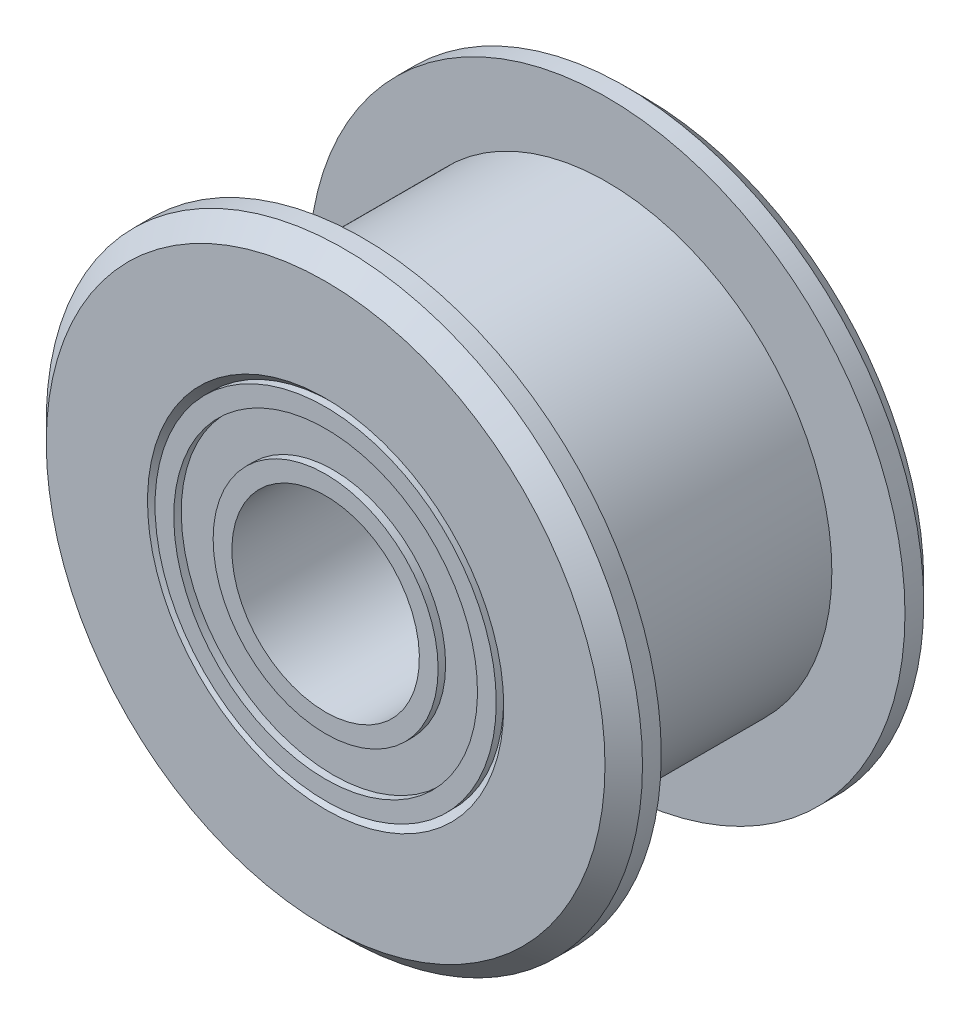
ISO-10303-21;
HEADER;
FILE_DESCRIPTION(('STEP AP214'),'2;1');
FILE_NAME('part.step','',(''),(''),'','','');
FILE_SCHEMA(('AUTOMOTIVE_DESIGN { 1 0 10303 214 1 1 1 1 }'));
ENDSEC;
DATA;
#1=APPLICATION_CONTEXT('core data for automotive mechanical design processes');
#2=APPLICATION_PROTOCOL_DEFINITION('international standard','automotive_design',2000,#1);
#3=PRODUCT_CONTEXT('',#1,'mechanical');
#4=PRODUCT('Part','Part','',(#3));
#5=PRODUCT_RELATED_PRODUCT_CATEGORY('part','',(#4));
#6=PRODUCT_DEFINITION_FORMATION('','',#4);
#7=PRODUCT_DEFINITION_CONTEXT('part definition',#1,'design');
#8=PRODUCT_DEFINITION('design','',#6,#7);
#9=PRODUCT_DEFINITION_SHAPE('','',#8);
#10=(LENGTH_UNIT() NAMED_UNIT(*) SI_UNIT(.MILLI.,.METRE.));
#11=(NAMED_UNIT(*) PLANE_ANGLE_UNIT() SI_UNIT($,.RADIAN.));
#12=(NAMED_UNIT(*) SI_UNIT($,.STERADIAN.) SOLID_ANGLE_UNIT());
#13=UNCERTAINTY_MEASURE_WITH_UNIT(LENGTH_MEASURE(1.E-05),#10,'distance_accuracy_value','');
#14=(GEOMETRIC_REPRESENTATION_CONTEXT(3) GLOBAL_UNCERTAINTY_ASSIGNED_CONTEXT((#13)) GLOBAL_UNIT_ASSIGNED_CONTEXT((#10,
#11,#12)) REPRESENTATION_CONTEXT('',''));
#15=CARTESIAN_POINT('',(0.,0.,0.));
#16=DIRECTION('',(0.,0.,1.));
#17=DIRECTION('',(1.,0.,0.));
#18=AXIS2_PLACEMENT_3D('',#15,#16,#17);
#19=CARTESIAN_POINT('',(0.,0.,-0.75));
#20=DIRECTION('',(0.,0.,1.));
#21=DIRECTION('',(1.,0.,0.));
#22=AXIS2_PLACEMENT_3D('',#19,#20,#21);
#23=CONICAL_SURFACE('',#22,7.7,0.785398163397449);
#24=CARTESIAN_POINT('',(0.,0.,-1.));
#25=DIRECTION('',(0.,0.,1.));
#26=DIRECTION('',(1.,0.,0.));
#27=AXIS2_PLACEMENT_3D('',#24,#25,#26);
#28=CIRCLE('',#27,7.45);
#29=CARTESIAN_POINT('',(7.45,0.,-1.));
#30=VERTEX_POINT('',#29);
#31=EDGE_CURVE('E9',#30,#30,#28,.T.);
#32=ORIENTED_EDGE('',*,*,#31,.T.);
#33=EDGE_LOOP('',(#32));
#34=FACE_BOUND('',#33,.T.);
#35=CARTESIAN_POINT('',(0.,0.,-0.5));
#36=DIRECTION('',(0.,0.,-1.));
#37=DIRECTION('',(0.,-1.,0.));
#38=AXIS2_PLACEMENT_3D('',#35,#36,#37);
#39=CIRCLE('',#38,7.95);
#40=CARTESIAN_POINT('',(0.,-7.95,-0.5));
#41=VERTEX_POINT('',#40);
#42=EDGE_CURVE('E22',#41,#41,#39,.T.);
#43=ORIENTED_EDGE('',*,*,#42,.T.);
#44=EDGE_LOOP('',(#43));
#45=FACE_BOUND('',#44,.T.);
#46=ADVANCED_FACE('F14',(#34,#45),#23,.T.);
#47=CARTESIAN_POINT('',(0.,0.,0.));
#48=DIRECTION('',(0.,0.,1.));
#49=DIRECTION('',(1.,0.,0.));
#50=AXIS2_PLACEMENT_3D('',#47,#48,#49);
#51=CYLINDRICAL_SURFACE('',#50,7.95);
#52=CARTESIAN_POINT('',(0.,0.,0.));
#53=DIRECTION('',(0.,0.,1.));
#54=DIRECTION('',(1.,0.,0.));
#55=AXIS2_PLACEMENT_3D('',#52,#53,#54);
#56=CIRCLE('',#55,7.95);
#57=CARTESIAN_POINT('',(7.95,0.,0.));
#58=VERTEX_POINT('',#57);
#59=EDGE_CURVE('E30',#58,#58,#56,.T.);
#60=ORIENTED_EDGE('',*,*,#59,.F.);
#61=EDGE_LOOP('',(#60));
#62=FACE_BOUND('',#61,.T.);
#63=ORIENTED_EDGE('',*,*,#42,.F.);
#64=EDGE_LOOP('',(#63));
#65=FACE_BOUND('',#64,.T.);
#66=ADVANCED_FACE('F114',(#62,#65),#51,.T.);
#67=CARTESIAN_POINT('',(0.,0.,-1.));
#68=DIRECTION('',(0.,0.,-1.));
#69=DIRECTION('',(-1.,0.,0.));
#70=AXIS2_PLACEMENT_3D('',#67,#68,#69);
#71=PLANE('',#70);
#72=CARTESIAN_POINT('',(0.,0.,-1.));
#73=DIRECTION('',(0.,0.,-1.));
#74=DIRECTION('',(0.,-1.,0.));
#75=AXIS2_PLACEMENT_3D('',#72,#73,#74);
#76=CIRCLE('',#75,4.75);
#77=CARTESIAN_POINT('',(0.,-4.75,-1.));
#78=VERTEX_POINT('',#77);
#79=EDGE_CURVE('E35',#78,#78,#76,.T.);
#80=ORIENTED_EDGE('',*,*,#79,.F.);
#81=EDGE_LOOP('',(#80));
#82=FACE_BOUND('',#81,.T.);
#83=ORIENTED_EDGE('',*,*,#31,.F.);
#84=EDGE_LOOP('',(#83));
#85=FACE_BOUND('',#84,.T.);
#86=ADVANCED_FACE('F119',(#82,#85),#71,.T.);
#87=CARTESIAN_POINT('',(0.,0.,7.25));
#88=DIRECTION('',(0.,0.,-1.));
#89=DIRECTION('',(1.,0.,0.));
#90=AXIS2_PLACEMENT_3D('',#87,#88,#89);
#91=CONICAL_SURFACE('',#90,7.7,0.785398163397448);
#92=CARTESIAN_POINT('',(0.,0.,7.));
#93=DIRECTION('',(0.,0.,1.));
#94=DIRECTION('',(1.,0.,0.));
#95=AXIS2_PLACEMENT_3D('',#92,#93,#94);
#96=CIRCLE('',#95,7.95);
#97=CARTESIAN_POINT('',(7.95,0.,7.));
#98=VERTEX_POINT('',#97);
#99=EDGE_CURVE('E27',#98,#98,#96,.T.);
#100=ORIENTED_EDGE('',*,*,#99,.T.);
#101=EDGE_LOOP('',(#100));
#102=FACE_BOUND('',#101,.T.);
#103=CARTESIAN_POINT('',(0.,0.,7.5));
#104=DIRECTION('',(0.,0.,-1.));
#105=DIRECTION('',(0.,-1.,0.));
#106=AXIS2_PLACEMENT_3D('',#103,#104,#105);
#107=CIRCLE('',#106,7.45);
#108=CARTESIAN_POINT('',(0.,-7.45,7.5));
#109=VERTEX_POINT('',#108);
#110=EDGE_CURVE('E42',#109,#109,#107,.T.);
#111=ORIENTED_EDGE('',*,*,#110,.T.);
#112=EDGE_LOOP('',(#111));
#113=FACE_BOUND('',#112,.T.);
#114=ADVANCED_FACE('F125',(#102,#113),#91,.T.);
#115=CARTESIAN_POINT('',(0.,0.,6.5));
#116=DIRECTION('',(0.,0.,1.));
#117=DIRECTION('',(1.,0.,0.));
#118=AXIS2_PLACEMENT_3D('',#115,#116,#117);
#119=CYLINDRICAL_SURFACE('',#118,7.95);
#120=CARTESIAN_POINT('',(0.,0.,6.5));
#121=DIRECTION('',(0.,0.,1.));
#122=DIRECTION('',(1.,0.,0.));
#123=AXIS2_PLACEMENT_3D('',#120,#121,#122);
#124=CIRCLE('',#123,7.95);
#125=CARTESIAN_POINT('',(7.95,0.,6.5));
#126=VERTEX_POINT('',#125);
#127=EDGE_CURVE('E45',#126,#126,#124,.T.);
#128=ORIENTED_EDGE('',*,*,#127,.T.);
#129=EDGE_LOOP('',(#128));
#130=FACE_BOUND('',#129,.T.);
#131=ORIENTED_EDGE('',*,*,#99,.F.);
#132=EDGE_LOOP('',(#131));
#133=FACE_BOUND('',#132,.T.);
#134=ADVANCED_FACE('F127',(#130,#133),#119,.T.);
#135=CARTESIAN_POINT('',(0.,0.,7.5));
#136=DIRECTION('',(0.,0.,1.));
#137=DIRECTION('',(1.,0.,0.));
#138=AXIS2_PLACEMENT_3D('',#135,#136,#137);
#139=PLANE('',#138);
#140=CARTESIAN_POINT('',(0.,0.,7.5));
#141=DIRECTION('',(0.,0.,-1.));
#142=DIRECTION('',(0.,-1.,0.));
#143=AXIS2_PLACEMENT_3D('',#140,#141,#142);
#144=CIRCLE('',#143,4.75);
#145=CARTESIAN_POINT('',(0.,-4.75,7.5));
#146=VERTEX_POINT('',#145);
#147=EDGE_CURVE('E33',#146,#146,#144,.T.);
#148=ORIENTED_EDGE('',*,*,#147,.T.);
#149=EDGE_LOOP('',(#148));
#150=FACE_BOUND('',#149,.T.);
#151=ORIENTED_EDGE('',*,*,#110,.F.);
#152=EDGE_LOOP('',(#151));
#153=FACE_BOUND('',#152,.T.);
#154=ADVANCED_FACE('F130',(#150,#153),#139,.T.);
#155=CARTESIAN_POINT('',(0.,0.,0.));
#156=DIRECTION('',(0.,0.,1.));
#157=DIRECTION('',(1.,0.,0.));
#158=AXIS2_PLACEMENT_3D('',#155,#156,#157);
#159=PLANE('',#158);
#160=ORIENTED_EDGE('',*,*,#59,.T.);
#161=EDGE_LOOP('',(#160));
#162=FACE_BOUND('',#161,.T.);
#163=CARTESIAN_POINT('',(0.,0.,0.));
#164=DIRECTION('',(0.,0.,1.));
#165=DIRECTION('',(1.,0.,0.));
#166=AXIS2_PLACEMENT_3D('',#163,#164,#165);
#167=CIRCLE('',#166,6.);
#168=CARTESIAN_POINT('',(6.,0.,0.));
#169=VERTEX_POINT('',#168);
#170=EDGE_CURVE('E50',#169,#169,#167,.T.);
#171=ORIENTED_EDGE('',*,*,#170,.F.);
#172=EDGE_LOOP('',(#171));
#173=FACE_BOUND('',#172,.T.);
#174=ADVANCED_FACE('F132',(#162,#173),#159,.T.);
#175=CARTESIAN_POINT('',(0.,0.,-1.));
#176=DIRECTION('',(0.,0.,-1.));
#177=DIRECTION('',(-1.,0.,0.));
#178=AXIS2_PLACEMENT_3D('',#175,#176,#177);
#179=PLANE('',#178);
#180=CARTESIAN_POINT('',(0.,0.,-1.));
#181=DIRECTION('',(0.,0.,1.));
#182=DIRECTION('',(1.,0.,0.));
#183=AXIS2_PLACEMENT_3D('',#180,#181,#182);
#184=CIRCLE('',#183,3.);
#185=CARTESIAN_POINT('',(3.,0.,-1.));
#186=VERTEX_POINT('',#185);
#187=EDGE_CURVE('E53',#186,#186,#184,.T.);
#188=ORIENTED_EDGE('',*,*,#187,.F.);
#189=EDGE_LOOP('',(#188));
#190=FACE_BOUND('',#189,.T.);
#191=CARTESIAN_POINT('',(0.,0.,-1.));
#192=DIRECTION('',(0.,0.,-1.));
#193=DIRECTION('',(0.,-1.,0.));
#194=AXIS2_PLACEMENT_3D('',#191,#192,#193);
#195=CIRCLE('',#194,2.5);
#196=CARTESIAN_POINT('',(0.,-2.5,-1.));
#197=VERTEX_POINT('',#196);
#198=EDGE_CURVE('E58',#197,#197,#195,.T.);
#199=ORIENTED_EDGE('',*,*,#198,.F.);
#200=EDGE_LOOP('',(#199));
#201=FACE_BOUND('',#200,.T.);
#202=ADVANCED_FACE('F135',(#190,#201),#179,.T.);
#203=CARTESIAN_POINT('',(0.,0.,-1.));
#204=DIRECTION('',(0.,0.,-1.));
#205=DIRECTION('',(0.,-1.,0.));
#206=AXIS2_PLACEMENT_3D('',#203,#204,#205);
#207=CYLINDRICAL_SURFACE('',#206,4.55);
#208=CARTESIAN_POINT('',(0.,0.,-0.8));
#209=DIRECTION('',(0.,0.,1.));
#210=DIRECTION('',(1.,0.,0.));
#211=AXIS2_PLACEMENT_3D('',#208,#209,#210);
#212=CIRCLE('',#211,4.55);
#213=CARTESIAN_POINT('',(4.55,0.,-0.8));
#214=VERTEX_POINT('',#213);
#215=EDGE_CURVE('E38',#214,#214,#212,.T.);
#216=ORIENTED_EDGE('',*,*,#215,.F.);
#217=EDGE_LOOP('',(#216));
#218=FACE_BOUND('',#217,.T.);
#219=CARTESIAN_POINT('',(0.,0.,-1.));
#220=DIRECTION('',(0.,0.,1.));
#221=DIRECTION('',(1.,0.,0.));
#222=AXIS2_PLACEMENT_3D('',#219,#220,#221);
#223=CIRCLE('',#222,4.55);
#224=CARTESIAN_POINT('',(4.55,0.,-1.));
#225=VERTEX_POINT('',#224);
#226=EDGE_CURVE('E34',#225,#225,#223,.T.);
#227=ORIENTED_EDGE('',*,*,#226,.T.);
#228=EDGE_LOOP('',(#227));
#229=FACE_BOUND('',#228,.T.);
#230=ADVANCED_FACE('F139',(#218,#229),#207,.T.);
#231=CARTESIAN_POINT('',(0.,0.,-0.9));
#232=DIRECTION('',(0.,0.,-1.));
#233=DIRECTION('',(1.,0.,0.));
#234=AXIS2_PLACEMENT_3D('',#231,#232,#233);
#235=CONICAL_SURFACE('',#234,4.65,0.785398163397448);
#236=ORIENTED_EDGE('',*,*,#215,.T.);
#237=EDGE_LOOP('',(#236));
#238=FACE_BOUND('',#237,.T.);
#239=ORIENTED_EDGE('',*,*,#79,.T.);
#240=EDGE_LOOP('',(#239));
#241=FACE_BOUND('',#240,.T.);
#242=ADVANCED_FACE('F149',(#238,#241),#235,.F.);
#243=CARTESIAN_POINT('',(0.,0.,-1.));
#244=DIRECTION('',(0.,0.,-1.));
#245=DIRECTION('',(-1.,0.,0.));
#246=AXIS2_PLACEMENT_3D('',#243,#244,#245);
#247=PLANE('',#246);
#248=ORIENTED_EDGE('',*,*,#226,.F.);
#249=EDGE_LOOP('',(#248));
#250=FACE_BOUND('',#249,.T.);
#251=CARTESIAN_POINT('',(0.,0.,-1.));
#252=DIRECTION('',(0.,0.,-1.));
#253=DIRECTION('',(0.,-1.,0.));
#254=AXIS2_PLACEMENT_3D('',#251,#252,#253);
#255=CIRCLE('',#254,4.05);
#256=CARTESIAN_POINT('',(0.,-4.05,-1.));
#257=VERTEX_POINT('',#256);
#258=EDGE_CURVE('E57',#257,#257,#255,.T.);
#259=ORIENTED_EDGE('',*,*,#258,.F.);
#260=EDGE_LOOP('',(#259));
#261=FACE_BOUND('',#260,.T.);
#262=ADVANCED_FACE('F145',(#250,#261),#247,.T.);
#263=CARTESIAN_POINT('',(0.,0.,-0.8));
#264=DIRECTION('',(0.,0.,-1.));
#265=DIRECTION('',(-1.,0.,0.));
#266=AXIS2_PLACEMENT_3D('',#263,#264,#265);
#267=PLANE('',#266);
#268=CARTESIAN_POINT('',(0.,0.,-0.8));
#269=DIRECTION('',(0.,0.,1.));
#270=DIRECTION('',(1.,0.,0.));
#271=AXIS2_PLACEMENT_3D('',#268,#269,#270);
#272=CIRCLE('',#271,3.);
#273=CARTESIAN_POINT('',(3.,0.,-0.8));
#274=VERTEX_POINT('',#273);
#275=EDGE_CURVE('E39',#274,#274,#272,.T.);
#276=ORIENTED_EDGE('',*,*,#275,.T.);
#277=EDGE_LOOP('',(#276));
#278=FACE_BOUND('',#277,.T.);
#279=CARTESIAN_POINT('',(0.,0.,-0.8));
#280=DIRECTION('',(0.,0.,-1.));
#281=DIRECTION('',(0.,-1.,0.));
#282=AXIS2_PLACEMENT_3D('',#279,#280,#281);
#283=CIRCLE('',#282,4.05);
#284=CARTESIAN_POINT('',(0.,-4.05,-0.8));
#285=VERTEX_POINT('',#284);
#286=EDGE_CURVE('E69',#285,#285,#283,.T.);
#287=ORIENTED_EDGE('',*,*,#286,.T.);
#288=EDGE_LOOP('',(#287));
#289=FACE_BOUND('',#288,.T.);
#290=ADVANCED_FACE('F141',(#278,#289),#267,.T.);
#291=CARTESIAN_POINT('',(0.,0.,-1.));
#292=DIRECTION('',(0.,0.,-1.));
#293=DIRECTION('',(0.,-1.,0.));
#294=AXIS2_PLACEMENT_3D('',#291,#292,#293);
#295=CYLINDRICAL_SURFACE('',#294,4.05);
#296=ORIENTED_EDGE('',*,*,#286,.F.);
#297=EDGE_LOOP('',(#296));
#298=FACE_BOUND('',#297,.T.);
#299=ORIENTED_EDGE('',*,*,#258,.T.);
#300=EDGE_LOOP('',(#299));
#301=FACE_BOUND('',#300,.T.);
#302=ADVANCED_FACE('F144',(#298,#301),#295,.F.);
#303=CARTESIAN_POINT('',(0.,0.,-1.));
#304=DIRECTION('',(0.,0.,-1.));
#305=DIRECTION('',(0.,-1.,0.));
#306=AXIS2_PLACEMENT_3D('',#303,#304,#305);
#307=CYLINDRICAL_SURFACE('',#306,3.);
#308=ORIENTED_EDGE('',*,*,#275,.F.);
#309=EDGE_LOOP('',(#308));
#310=FACE_BOUND('',#309,.T.);
#311=ORIENTED_EDGE('',*,*,#187,.T.);
#312=EDGE_LOOP('',(#311));
#313=FACE_BOUND('',#312,.T.);
#314=ADVANCED_FACE('F155',(#310,#313),#307,.T.);
#315=CARTESIAN_POINT('',(0.,0.,0.));
#316=DIRECTION('',(0.,0.,1.));
#317=DIRECTION('',(1.,0.,0.));
#318=AXIS2_PLACEMENT_3D('',#315,#316,#317);
#319=CYLINDRICAL_SURFACE('',#318,6.);
#320=CARTESIAN_POINT('',(0.,0.,6.5));
#321=DIRECTION('',(0.,0.,1.));
#322=DIRECTION('',(1.,0.,0.));
#323=AXIS2_PLACEMENT_3D('',#320,#321,#322);
#324=CIRCLE('',#323,6.);
#325=CARTESIAN_POINT('',(6.,0.,6.5));
#326=VERTEX_POINT('',#325);
#327=EDGE_CURVE('E62',#326,#326,#324,.T.);
#328=ORIENTED_EDGE('',*,*,#327,.F.);
#329=EDGE_LOOP('',(#328));
#330=FACE_BOUND('',#329,.T.);
#331=ORIENTED_EDGE('',*,*,#170,.T.);
#332=EDGE_LOOP('',(#331));
#333=FACE_BOUND('',#332,.T.);
#334=ADVANCED_FACE('F151',(#330,#333),#319,.T.);
#335=CARTESIAN_POINT('',(0.,0.,7.5));
#336=DIRECTION('',(0.,0.,1.));
#337=DIRECTION('',(1.,0.,0.));
#338=AXIS2_PLACEMENT_3D('',#335,#336,#337);
#339=PLANE('',#338);
#340=CARTESIAN_POINT('',(0.,0.,7.5));
#341=DIRECTION('',(0.,0.,1.));
#342=DIRECTION('',(1.,0.,0.));
#343=AXIS2_PLACEMENT_3D('',#340,#341,#342);
#344=CIRCLE('',#343,3.);
#345=CARTESIAN_POINT('',(3.,0.,7.5));
#346=VERTEX_POINT('',#345);
#347=EDGE_CURVE('E54',#346,#346,#344,.T.);
#348=ORIENTED_EDGE('',*,*,#347,.T.);
#349=EDGE_LOOP('',(#348));
#350=FACE_BOUND('',#349,.T.);
#351=CARTESIAN_POINT('',(0.,0.,7.5));
#352=DIRECTION('',(0.,0.,-1.));
#353=DIRECTION('',(0.,-1.,0.));
#354=AXIS2_PLACEMENT_3D('',#351,#352,#353);
#355=CIRCLE('',#354,2.5);
#356=CARTESIAN_POINT('',(0.,-2.5,7.5));
#357=VERTEX_POINT('',#356);
#358=EDGE_CURVE('E78',#357,#357,#355,.T.);
#359=ORIENTED_EDGE('',*,*,#358,.T.);
#360=EDGE_LOOP('',(#359));
#361=FACE_BOUND('',#360,.T.);
#362=ADVANCED_FACE('F154',(#350,#361),#339,.T.);
#363=CARTESIAN_POINT('',(0.,0.,7.5));
#364=DIRECTION('',(0.,0.,-1.));
#365=DIRECTION('',(0.,-1.,0.));
#366=AXIS2_PLACEMENT_3D('',#363,#364,#365);
#367=CYLINDRICAL_SURFACE('',#366,4.55);
#368=CARTESIAN_POINT('',(0.,0.,7.3));
#369=DIRECTION('',(0.,0.,1.));
#370=DIRECTION('',(1.,0.,0.));
#371=AXIS2_PLACEMENT_3D('',#368,#369,#370);
#372=CIRCLE('',#371,4.55);
#373=CARTESIAN_POINT('',(4.55,0.,7.3));
#374=VERTEX_POINT('',#373);
#375=EDGE_CURVE('E81',#374,#374,#372,.T.);
#376=ORIENTED_EDGE('',*,*,#375,.T.);
#377=EDGE_LOOP('',(#376));
#378=FACE_BOUND('',#377,.T.);
#379=CARTESIAN_POINT('',(0.,0.,7.5));
#380=DIRECTION('',(0.,0.,1.));
#381=DIRECTION('',(1.,0.,0.));
#382=AXIS2_PLACEMENT_3D('',#379,#380,#381);
#383=CIRCLE('',#382,4.55);
#384=CARTESIAN_POINT('',(4.55,0.,7.5));
#385=VERTEX_POINT('',#384);
#386=EDGE_CURVE('E84',#385,#385,#383,.T.);
#387=ORIENTED_EDGE('',*,*,#386,.F.);
#388=EDGE_LOOP('',(#387));
#389=FACE_BOUND('',#388,.T.);
#390=ADVANCED_FACE('F157',(#378,#389),#367,.T.);
#391=CARTESIAN_POINT('',(0.,0.,7.4));
#392=DIRECTION('',(0.,0.,1.));
#393=DIRECTION('',(1.,0.,0.));
#394=AXIS2_PLACEMENT_3D('',#391,#392,#393);
#395=CONICAL_SURFACE('',#394,4.65,0.785398163397448);
#396=ORIENTED_EDGE('',*,*,#375,.F.);
#397=EDGE_LOOP('',(#396));
#398=FACE_BOUND('',#397,.T.);
#399=ORIENTED_EDGE('',*,*,#147,.F.);
#400=EDGE_LOOP('',(#399));
#401=FACE_BOUND('',#400,.T.);
#402=ADVANCED_FACE('F109',(#398,#401),#395,.F.);
#403=CARTESIAN_POINT('',(0.,0.,7.5));
#404=DIRECTION('',(0.,0.,1.));
#405=DIRECTION('',(1.,0.,0.));
#406=AXIS2_PLACEMENT_3D('',#403,#404,#405);
#407=PLANE('',#406);
#408=ORIENTED_EDGE('',*,*,#386,.T.);
#409=EDGE_LOOP('',(#408));
#410=FACE_BOUND('',#409,.T.);
#411=CARTESIAN_POINT('',(0.,0.,7.5));
#412=DIRECTION('',(0.,0.,-1.));
#413=DIRECTION('',(0.,-1.,0.));
#414=AXIS2_PLACEMENT_3D('',#411,#412,#413);
#415=CIRCLE('',#414,4.05);
#416=CARTESIAN_POINT('',(0.,-4.05,7.5));
#417=VERTEX_POINT('',#416);
#418=EDGE_CURVE('E87',#417,#417,#415,.T.);
#419=ORIENTED_EDGE('',*,*,#418,.T.);
#420=EDGE_LOOP('',(#419));
#421=FACE_BOUND('',#420,.T.);
#422=ADVANCED_FACE('F100',(#410,#421),#407,.T.);
#423=CARTESIAN_POINT('',(0.,0.,7.3));
#424=DIRECTION('',(0.,0.,1.));
#425=DIRECTION('',(1.,0.,0.));
#426=AXIS2_PLACEMENT_3D('',#423,#424,#425);
#427=PLANE('',#426);
#428=CARTESIAN_POINT('',(0.,0.,7.3));
#429=DIRECTION('',(0.,0.,1.));
#430=DIRECTION('',(1.,0.,0.));
#431=AXIS2_PLACEMENT_3D('',#428,#429,#430);
#432=CIRCLE('',#431,3.);
#433=CARTESIAN_POINT('',(3.,0.,7.3));
#434=VERTEX_POINT('',#433);
#435=EDGE_CURVE('E61',#434,#434,#432,.T.);
#436=ORIENTED_EDGE('',*,*,#435,.F.);
#437=EDGE_LOOP('',(#436));
#438=FACE_BOUND('',#437,.T.);
#439=CARTESIAN_POINT('',(0.,0.,7.3));
#440=DIRECTION('',(0.,0.,-1.));
#441=DIRECTION('',(0.,-1.,0.));
#442=AXIS2_PLACEMENT_3D('',#439,#440,#441);
#443=CIRCLE('',#442,4.05);
#444=CARTESIAN_POINT('',(0.,-4.05,7.3));
#445=VERTEX_POINT('',#444);
#446=EDGE_CURVE('E18',#445,#445,#443,.T.);
#447=ORIENTED_EDGE('',*,*,#446,.F.);
#448=EDGE_LOOP('',(#447));
#449=FACE_BOUND('',#448,.T.);
#450=ADVANCED_FACE('F98',(#438,#449),#427,.T.);
#451=CARTESIAN_POINT('',(0.,0.,7.5));
#452=DIRECTION('',(0.,0.,-1.));
#453=DIRECTION('',(0.,-1.,0.));
#454=AXIS2_PLACEMENT_3D('',#451,#452,#453);
#455=CYLINDRICAL_SURFACE('',#454,4.05);
#456=ORIENTED_EDGE('',*,*,#446,.T.);
#457=EDGE_LOOP('',(#456));
#458=FACE_BOUND('',#457,.T.);
#459=ORIENTED_EDGE('',*,*,#418,.F.);
#460=EDGE_LOOP('',(#459));
#461=FACE_BOUND('',#460,.T.);
#462=ADVANCED_FACE('F95',(#458,#461),#455,.F.);
#463=CARTESIAN_POINT('',(0.,0.,7.5));
#464=DIRECTION('',(0.,0.,-1.));
#465=DIRECTION('',(0.,-1.,0.));
#466=AXIS2_PLACEMENT_3D('',#463,#464,#465);
#467=CYLINDRICAL_SURFACE('',#466,3.);
#468=ORIENTED_EDGE('',*,*,#435,.T.);
#469=EDGE_LOOP('',(#468));
#470=FACE_BOUND('',#469,.T.);
#471=ORIENTED_EDGE('',*,*,#347,.F.);
#472=EDGE_LOOP('',(#471));
#473=FACE_BOUND('',#472,.T.);
#474=ADVANCED_FACE('F16',(#470,#473),#467,.T.);
#475=CARTESIAN_POINT('',(0.,0.,0.));
#476=DIRECTION('',(0.,0.,1.));
#477=DIRECTION('',(1.,0.,0.));
#478=AXIS2_PLACEMENT_3D('',#475,#476,#477);
#479=CYLINDRICAL_SURFACE('',#478,2.5);
#480=ORIENTED_EDGE('',*,*,#198,.T.);
#481=EDGE_LOOP('',(#480));
#482=FACE_BOUND('',#481,.T.);
#483=ORIENTED_EDGE('',*,*,#358,.F.);
#484=EDGE_LOOP('',(#483));
#485=FACE_BOUND('',#484,.T.);
#486=ADVANCED_FACE('F161',(#482,#485),#479,.F.);
#487=CARTESIAN_POINT('',(0.,0.,6.5));
#488=DIRECTION('',(0.,0.,-1.));
#489=DIRECTION('',(-1.,0.,0.));
#490=AXIS2_PLACEMENT_3D('',#487,#488,#489);
#491=PLANE('',#490);
#492=ORIENTED_EDGE('',*,*,#327,.T.);
#493=EDGE_LOOP('',(#492));
#494=FACE_BOUND('',#493,.T.);
#495=ORIENTED_EDGE('',*,*,#127,.F.);
#496=EDGE_LOOP('',(#495));
#497=FACE_BOUND('',#496,.T.);
#498=ADVANCED_FACE('F163',(#494,#497),#491,.T.);
#499=CLOSED_SHELL('',(#46,#66,#86,#114,#134,#154,#174,#202,#230,#242,#262,#290,#302,#314,#334,
#362,#390,#402,#422,#450,#462,#474,#486,#498));
#500=MANIFOLD_SOLID_BREP('B1',#499);
#501=ADVANCED_BREP_SHAPE_REPRESENTATION('',(#18,#500),#14);
#502=SHAPE_DEFINITION_REPRESENTATION(#9,#501);
ENDSEC;
END-ISO-10303-21;
